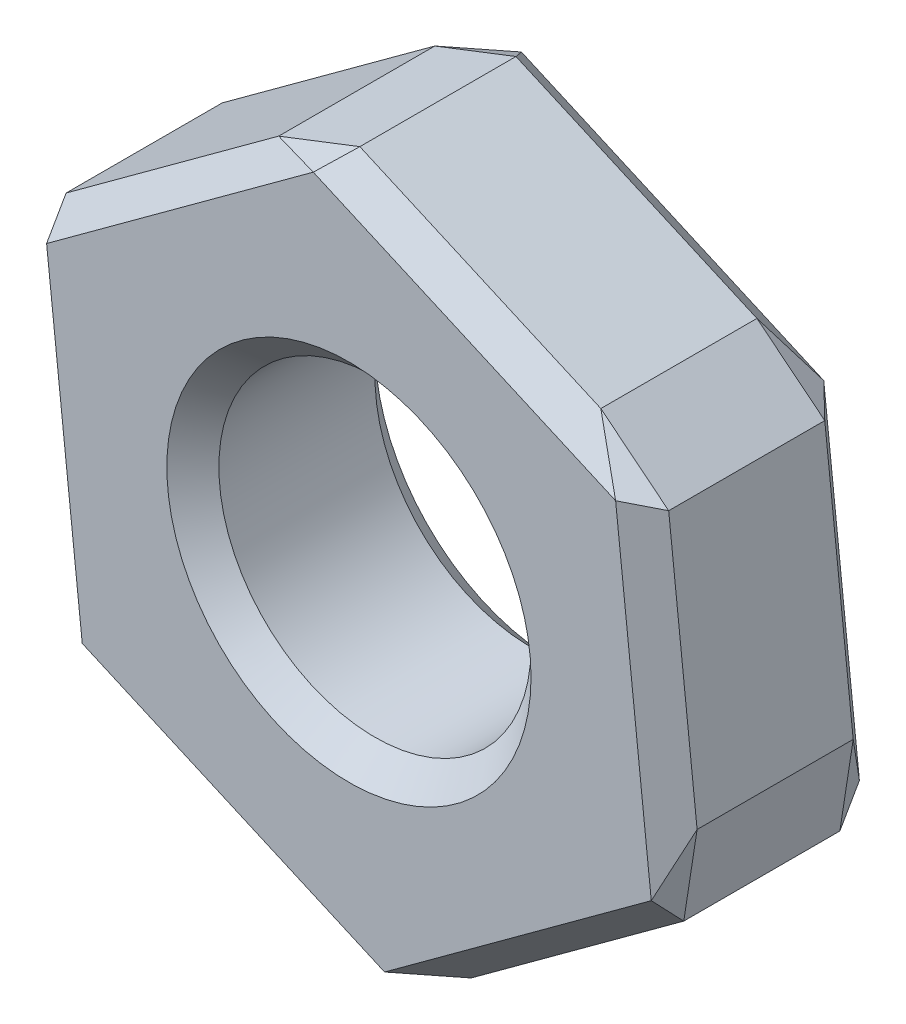
ISO-10303-21;
HEADER;
FILE_DESCRIPTION(('STEP AP214'),'2;1');
FILE_NAME('part.step','',(''),(''),'','','');
FILE_SCHEMA(('AUTOMOTIVE_DESIGN { 1 0 10303 214 1 1 1 1 }'));
ENDSEC;
DATA;
#1=APPLICATION_CONTEXT('core data for automotive mechanical design processes');
#2=APPLICATION_PROTOCOL_DEFINITION('international standard','automotive_design',2000,#1);
#3=PRODUCT_CONTEXT('',#1,'mechanical');
#4=PRODUCT('Part','Part','',(#3));
#5=PRODUCT_RELATED_PRODUCT_CATEGORY('part','',(#4));
#6=PRODUCT_DEFINITION_FORMATION('','',#4);
#7=PRODUCT_DEFINITION_CONTEXT('part definition',#1,'design');
#8=PRODUCT_DEFINITION('design','',#6,#7);
#9=PRODUCT_DEFINITION_SHAPE('','',#8);
#10=(LENGTH_UNIT() NAMED_UNIT(*) SI_UNIT(.MILLI.,.METRE.));
#11=(NAMED_UNIT(*) PLANE_ANGLE_UNIT() SI_UNIT($,.RADIAN.));
#12=(NAMED_UNIT(*) SI_UNIT($,.STERADIAN.) SOLID_ANGLE_UNIT());
#13=UNCERTAINTY_MEASURE_WITH_UNIT(LENGTH_MEASURE(1.E-05),#10,'distance_accuracy_value','');
#14=(GEOMETRIC_REPRESENTATION_CONTEXT(3) GLOBAL_UNCERTAINTY_ASSIGNED_CONTEXT((#13)) GLOBAL_UNIT_ASSIGNED_CONTEXT((#10,
#11,#12)) REPRESENTATION_CONTEXT('',''));
#15=CARTESIAN_POINT('',(0.,0.,0.));
#16=DIRECTION('',(0.,0.,1.));
#17=DIRECTION('',(1.,0.,0.));
#18=AXIS2_PLACEMENT_3D('',#15,#16,#17);
#19=CARTESIAN_POINT('',(0.,0.,2.));
#20=DIRECTION('',(0.,0.,1.));
#21=DIRECTION('',(1.,0.,0.));
#22=AXIS2_PLACEMENT_3D('',#19,#20,#21);
#23=PLANE('',#22);
#24=DIRECTION('',(0.107896227902618,-0.994162161824914,0.));
#25=VECTOR('',#24,1.);
#26=CARTESIAN_POINT('',(-111.632965353091,203.991077085588,2.));
#27=LINE('',#26,#25);
#28=CARTESIAN_POINT('',(-111.991155371379,207.291460888137,2.));
#29=VERTEX_POINT('',#28);
#30=CARTESIAN_POINT('',(-111.648538832147,204.134572033525,2.));
#31=VERTEX_POINT('',#30);
#32=EDGE_CURVE('E257',#29,#31,#27,.T.);
#33=ORIENTED_EDGE('',*,*,#32,.T.);
#34=DIRECTION('',(0.914917801572941,-0.403640206576274,0.));
#35=VECTOR('',#34,1.);
#36=CARTESIAN_POINT('',(-108.611227607756,202.79458178747,2.));
#37=LINE('',#36,#35);
#38=CARTESIAN_POINT('',(-108.743284617512,202.852842232951,2.));
#39=VERTEX_POINT('',#38);
#40=EDGE_CURVE('E259',#31,#39,#37,.T.);
#41=ORIENTED_EDGE('',*,*,#40,.T.);
#42=DIRECTION('',(0.807021573670326,0.590521955248635,0.));
#43=VECTOR('',#42,1.);
#44=CARTESIAN_POINT('',(-106.06416341141,204.813235789445,2.));
#45=LINE('',#44,#43);
#46=CARTESIAN_POINT('',(-106.18064694211,204.728001286989,2.));
#47=VERTEX_POINT('',#46);
#48=EDGE_CURVE('E249',#39,#47,#45,.T.);
#49=ORIENTED_EDGE('',*,*,#48,.T.);
#50=DIRECTION('',(-0.107896227902617,0.994162161824914,0.));
#51=VECTOR('',#50,1.);
#52=CARTESIAN_POINT('',(-106.538836960398,208.028385089539,2.));
#53=LINE('',#52,#51);
#54=CARTESIAN_POINT('',(-106.523263481342,207.884890141602,2.));
#55=VERTEX_POINT('',#54);
#56=EDGE_CURVE('E251',#47,#55,#53,.T.);
#57=ORIENTED_EDGE('',*,*,#56,.T.);
#58=DIRECTION('',(-0.914917801572941,0.403640206576274,0.));
#59=VECTOR('',#58,1.);
#60=CARTESIAN_POINT('',(-109.560574705733,209.224880387657,2.));
#61=LINE('',#60,#59);
#62=CARTESIAN_POINT('',(-109.428517695977,209.166619942176,2.));
#63=VERTEX_POINT('',#62);
#64=EDGE_CURVE('E253',#55,#63,#61,.T.);
#65=ORIENTED_EDGE('',*,*,#64,.T.);
#66=DIRECTION('',(-0.807021573670322,-0.590521955248641,0.));
#67=VECTOR('',#66,1.);
#68=CARTESIAN_POINT('',(-112.10763890208,207.206226385681,2.));
#69=LINE('',#68,#67);
#70=EDGE_CURVE('E255',#63,#29,#69,.T.);
#71=ORIENTED_EDGE('',*,*,#70,.T.);
#72=EDGE_LOOP('',(#33,#41,#49,#57,#65,#71));
#73=FACE_BOUND('',#72,.T.);
#74=CARTESIAN_POINT('',(-109.085901156745,206.009731087563,2.));
#75=DIRECTION('',(0.,0.,1.));
#76=DIRECTION('',(1.,0.,0.));
#77=AXIS2_PLACEMENT_3D('',#74,#75,#76);
#78=CIRCLE('',#77,1.74999999999996);
#79=CARTESIAN_POINT('',(-107.335901156745,206.009731087563,2.));
#80=VERTEX_POINT('',#79);
#81=EDGE_CURVE('E246',#80,#80,#78,.F.);
#82=ORIENTED_EDGE('',*,*,#81,.T.);
#83=EDGE_LOOP('',(#82));
#84=FACE_BOUND('',#83,.T.);
#85=ADVANCED_FACE('F34',(#73,#84),#23,.T.);
#86=CARTESIAN_POINT('',(0.,0.,0.));
#87=DIRECTION('',(0.,0.,1.));
#88=DIRECTION('',(1.,0.,0.));
#89=AXIS2_PLACEMENT_3D('',#86,#87,#88);
#90=PLANE('',#89);
#91=DIRECTION('',(-0.807021573670326,-0.590521955248635,0.));
#92=VECTOR('',#91,1.);
#93=CARTESIAN_POINT('',(-134.592896079612,183.937904143262,0.));
#94=LINE('',#93,#92);
#95=CARTESIAN_POINT('',(-106.18064694211,204.728001286989,0.));
#96=VERTEX_POINT('',#95);
#97=CARTESIAN_POINT('',(-108.743284617512,202.852842232951,0.));
#98=VERTEX_POINT('',#97);
#99=EDGE_CURVE('E265',#96,#98,#94,.T.);
#100=ORIENTED_EDGE('',*,*,#99,.T.);
#101=DIRECTION('',(-0.914917801572941,0.403640206576274,0.));
#102=VECTOR('',#101,1.);
#103=CARTESIAN_POINT('',(57.1960249817979,129.644323292083,0.));
#104=LINE('',#103,#102);
#105=CARTESIAN_POINT('',(-111.648538832147,204.134572033525,0.));
#106=VERTEX_POINT('',#105);
#107=EDGE_CURVE('E274',#98,#106,#104,.T.);
#108=ORIENTED_EDGE('',*,*,#107,.T.);
#109=DIRECTION('',(-0.107896227902618,0.994162161824914,0.));
#110=VECTOR('',#109,1.);
#111=CARTESIAN_POINT('',(-88.4520017734713,-9.59967871265047,0.));
#112=LINE('',#111,#110);
#113=CARTESIAN_POINT('',(-111.991155371379,207.291460888137,0.));
#114=VERTEX_POINT('',#113);
#115=EDGE_CURVE('E60',#106,#114,#112,.T.);
#116=ORIENTED_EDGE('',*,*,#115,.T.);
#117=DIRECTION('',(0.807021573670322,0.590521955248641,0.));
#118=VECTOR('',#117,1.);
#119=CARTESIAN_POINT('',(-137.840766833481,188.376522798448,0.));
#120=LINE('',#119,#118);
#121=CARTESIAN_POINT('',(-109.428517695977,209.166619942176,0.));
#122=VERTEX_POINT('',#121);
#123=EDGE_CURVE('E271',#114,#122,#120,.T.);
#124=ORIENTED_EDGE('',*,*,#123,.T.);
#125=DIRECTION('',(0.914917801572941,-0.403640206576274,0.));
#126=VECTOR('',#125,1.);
#127=CARTESIAN_POINT('',(59.4160461179675,134.676371200734,0.));
#128=LINE('',#127,#126);
#129=CARTESIAN_POINT('',(-106.523263481342,207.884890141602,0.));
#130=VERTEX_POINT('',#129);
#131=EDGE_CURVE('E269',#122,#130,#128,.T.);
#132=ORIENTED_EDGE('',*,*,#131,.T.);
#133=DIRECTION('',(0.107896227902617,-0.994162161824914,0.));
#134=VECTOR('',#133,1.);
#135=CARTESIAN_POINT('',(-82.9841098834344,-9.00624945918601,0.));
#136=LINE('',#135,#134);
#137=EDGE_CURVE('E267',#130,#96,#136,.T.);
#138=ORIENTED_EDGE('',*,*,#137,.T.);
#139=EDGE_LOOP('',(#100,#108,#116,#124,#132,#138));
#140=FACE_BOUND('',#139,.T.);
#141=CARTESIAN_POINT('',(-109.085901156745,206.009731087563,0.));
#142=DIRECTION('',(0.,0.,1.));
#143=DIRECTION('',(1.,0.,0.));
#144=AXIS2_PLACEMENT_3D('',#141,#142,#143);
#145=CIRCLE('',#144,1.74999999999996);
#146=CARTESIAN_POINT('',(-107.335901156745,206.009731087563,0.));
#147=VERTEX_POINT('',#146);
#148=EDGE_CURVE('E262',#147,#147,#145,.T.);
#149=ORIENTED_EDGE('',*,*,#148,.T.);
#150=EDGE_LOOP('',(#149));
#151=FACE_BOUND('',#150,.T.);
#152=ADVANCED_FACE('F435',(#140,#151),#90,.F.);
#153=CARTESIAN_POINT('',(-108.7121376594,202.565852337077,2.));
#154=DIRECTION('',(-0.590521955248635,0.807021573670326,0.));
#155=DIRECTION('',(-0.807021573670326,-0.590521955248635,0.));
#156=AXIS2_PLACEMENT_3D('',#153,#154,#155);
#157=PLANE('',#156);
#158=DIRECTION('',(0.,0.,1.));
#159=VECTOR('',#158,1.);
#160=CARTESIAN_POINT('',(-106.118288316015,204.463849907216,2.));
#161=LINE('',#160,#159);
#162=CARTESIAN_POINT('',(-106.118288316015,204.463849907216,0.250000000000003));
#163=VERTEX_POINT('',#162);
#164=CARTESIAN_POINT('',(-106.118288316015,204.463849907216,1.75));
#165=VERTEX_POINT('',#164);
#166=EDGE_CURVE('E171',#163,#165,#161,.T.);
#167=ORIENTED_EDGE('',*,*,#166,.T.);
#168=DIRECTION('',(-0.807021573670326,-0.590521955248635,0.));
#169=VECTOR('',#168,1.);
#170=CARTESIAN_POINT('',(-108.7121376594,202.565852337077,1.75));
#171=LINE('',#170,#169);
#172=CARTESIAN_POINT('',(-108.160931673882,202.969186333258,1.75));
#173=VERTEX_POINT('',#172);
#174=EDGE_CURVE('E208',#165,#173,#171,.T.);
#175=ORIENTED_EDGE('',*,*,#174,.T.);
#176=DIRECTION('',(0.,0.,-1.));
#177=VECTOR('',#176,1.);
#178=CARTESIAN_POINT('',(-108.160931673882,202.969186333258,2.));
#179=LINE('',#178,#177);
#180=CARTESIAN_POINT('',(-108.160931673882,202.969186333258,0.250000000000003));
#181=VERTEX_POINT('',#180);
#182=EDGE_CURVE('E205',#173,#181,#179,.T.);
#183=ORIENTED_EDGE('',*,*,#182,.T.);
#184=DIRECTION('',(0.807021573670326,0.590521955248635,0.));
#185=VECTOR('',#184,1.);
#186=CARTESIAN_POINT('',(-108.7121376594,202.565852337077,0.250000000000003));
#187=LINE('',#186,#185);
#188=EDGE_CURVE('E200',#181,#163,#187,.T.);
#189=ORIENTED_EDGE('',*,*,#188,.T.);
#190=EDGE_LOOP('',(#167,#175,#183,#189));
#191=FACE_BOUND('',#190,.T.);
#192=ADVANCED_FACE('F440',(#191),#157,.F.);
#193=CARTESIAN_POINT('',(-105.916532922597,204.611480396028,2.));
#194=DIRECTION('',(-0.994162161824914,-0.107896227902617,0.));
#195=DIRECTION('',(0.107896227902617,-0.994162161824914,0.));
#196=AXIS2_PLACEMENT_3D('',#193,#194,#195);
#197=PLANE('',#196);
#198=DIRECTION('',(0.,0.,1.));
#199=VECTOR('',#198,1.);
#200=CARTESIAN_POINT('',(-106.263322362967,207.806818606058,2.));
#201=LINE('',#200,#199);
#202=CARTESIAN_POINT('',(-106.263322362967,207.806818606058,0.250000000000003));
#203=VERTEX_POINT('',#202);
#204=CARTESIAN_POINT('',(-106.263322362967,207.806818606058,1.75));
#205=VERTEX_POINT('',#204);
#206=EDGE_CURVE('E193',#203,#205,#201,.T.);
#207=ORIENTED_EDGE('',*,*,#206,.T.);
#208=DIRECTION('',(0.107896227902617,-0.994162161824914,0.));
#209=VECTOR('',#208,1.);
#210=CARTESIAN_POINT('',(-105.916532922597,204.611480396028,1.75));
#211=LINE('',#210,#209);
#212=CARTESIAN_POINT('',(-105.990227416741,205.290505780295,1.75));
#213=VERTEX_POINT('',#212);
#214=EDGE_CURVE('E197',#205,#213,#211,.T.);
#215=ORIENTED_EDGE('',*,*,#214,.T.);
#216=DIRECTION('',(0.,0.,-1.));
#217=VECTOR('',#216,1.);
#218=CARTESIAN_POINT('',(-105.990227416741,205.290505780295,2.));
#219=LINE('',#218,#217);
#220=CARTESIAN_POINT('',(-105.990227416741,205.290505780295,0.250000000000003));
#221=VERTEX_POINT('',#220);
#222=EDGE_CURVE('E169',#213,#221,#219,.T.);
#223=ORIENTED_EDGE('',*,*,#222,.T.);
#224=DIRECTION('',(-0.107896227902617,0.994162161824914,0.));
#225=VECTOR('',#224,1.);
#226=CARTESIAN_POINT('',(-105.916532922597,204.611480396028,0.250000000000003));
#227=LINE('',#226,#225);
#228=EDGE_CURVE('E187',#221,#203,#227,.T.);
#229=ORIENTED_EDGE('',*,*,#228,.T.);
#230=EDGE_LOOP('',(#207,#215,#223,#229));
#231=FACE_BOUND('',#230,.T.);
#232=ADVANCED_FACE('F195',(#231),#197,.F.);
#233=CARTESIAN_POINT('',(-106.290296419942,208.055359146514,2.));
#234=DIRECTION('',(-0.403640206576274,-0.914917801572941,0.));
#235=DIRECTION('',(0.914917801572941,-0.403640206576274,0.));
#236=AXIS2_PLACEMENT_3D('',#233,#234,#235);
#237=PLANE('',#236);
#238=DIRECTION('',(0.,0.,1.));
#239=VECTOR('',#238,1.);
#240=CARTESIAN_POINT('',(-109.230935203696,209.352699786406,2.));
#241=LINE('',#240,#239);
#242=CARTESIAN_POINT('',(-109.230935203696,209.352699786406,0.250000000000003));
#243=VERTEX_POINT('',#242);
#244=CARTESIAN_POINT('',(-109.230935203696,209.352699786406,1.75));
#245=VERTEX_POINT('',#244);
#246=EDGE_CURVE('E212',#243,#245,#241,.T.);
#247=ORIENTED_EDGE('',*,*,#246,.T.);
#248=DIRECTION('',(0.914917801572941,-0.403640206576274,0.));
#249=VECTOR('',#248,1.);
#250=CARTESIAN_POINT('',(-106.290296419942,208.055359146514,1.75));
#251=LINE('',#250,#249);
#252=CARTESIAN_POINT('',(-106.915196899604,208.3310505346,1.75));
#253=VERTEX_POINT('',#252);
#254=EDGE_CURVE('E217',#245,#253,#251,.T.);
#255=ORIENTED_EDGE('',*,*,#254,.T.);
#256=DIRECTION('',(0.,0.,-1.));
#257=VECTOR('',#256,1.);
#258=CARTESIAN_POINT('',(-106.915196899604,208.3310505346,2.));
#259=LINE('',#258,#257);
#260=CARTESIAN_POINT('',(-106.915196899604,208.3310505346,0.250000000000003));
#261=VERTEX_POINT('',#260);
#262=EDGE_CURVE('E214',#253,#261,#259,.T.);
#263=ORIENTED_EDGE('',*,*,#262,.T.);
#264=DIRECTION('',(-0.914917801572941,0.403640206576274,0.));
#265=VECTOR('',#264,1.);
#266=CARTESIAN_POINT('',(-106.290296419942,208.055359146514,0.250000000000003));
#267=LINE('',#266,#265);
#268=EDGE_CURVE('E210',#261,#243,#267,.T.);
#269=ORIENTED_EDGE('',*,*,#268,.T.);
#270=EDGE_LOOP('',(#247,#255,#263,#269));
#271=FACE_BOUND('',#270,.T.);
#272=ADVANCED_FACE('F453',(#271),#237,.F.);
#273=CARTESIAN_POINT('',(-109.459664654089,209.45360983805,2.));
#274=DIRECTION('',(0.590521955248641,-0.807021573670322,0.));
#275=DIRECTION('',(0.807021573670322,0.590521955248641,0.));
#276=AXIS2_PLACEMENT_3D('',#273,#274,#275);
#277=PLANE('',#276);
#278=DIRECTION('',(0.,0.,1.));
#279=VECTOR('',#278,1.);
#280=CARTESIAN_POINT('',(-112.053513997474,207.555612267911,2.));
#281=LINE('',#280,#279);
#282=CARTESIAN_POINT('',(-112.053513997474,207.555612267911,0.250000000000003));
#283=VERTEX_POINT('',#282);
#284=CARTESIAN_POINT('',(-112.053513997474,207.555612267911,1.75));
#285=VERTEX_POINT('',#284);
#286=EDGE_CURVE('E221',#283,#285,#281,.T.);
#287=ORIENTED_EDGE('',*,*,#286,.T.);
#288=DIRECTION('',(0.807021573670322,0.590521955248641,0.));
#289=VECTOR('',#288,1.);
#290=CARTESIAN_POINT('',(-109.459664654089,209.45360983805,1.75));
#291=LINE('',#290,#289);
#292=CARTESIAN_POINT('',(-110.010870639607,209.050275841869,1.75));
#293=VERTEX_POINT('',#292);
#294=EDGE_CURVE('E226',#285,#293,#291,.T.);
#295=ORIENTED_EDGE('',*,*,#294,.T.);
#296=DIRECTION('',(0.,0.,-1.));
#297=VECTOR('',#296,1.);
#298=CARTESIAN_POINT('',(-110.010870639607,209.050275841869,2.));
#299=LINE('',#298,#297);
#300=CARTESIAN_POINT('',(-110.010870639607,209.050275841869,0.250000000000003));
#301=VERTEX_POINT('',#300);
#302=EDGE_CURVE('E223',#293,#301,#299,.T.);
#303=ORIENTED_EDGE('',*,*,#302,.T.);
#304=DIRECTION('',(-0.807021573670322,-0.590521955248641,0.));
#305=VECTOR('',#304,1.);
#306=CARTESIAN_POINT('',(-109.459664654089,209.45360983805,0.250000000000003));
#307=LINE('',#306,#305);
#308=EDGE_CURVE('E219',#301,#283,#307,.T.);
#309=ORIENTED_EDGE('',*,*,#308,.T.);
#310=EDGE_LOOP('',(#287,#295,#303,#309));
#311=FACE_BOUND('',#310,.T.);
#312=ADVANCED_FACE('F393',(#311),#277,.F.);
#313=CARTESIAN_POINT('',(-112.255269390892,207.407981779099,2.));
#314=DIRECTION('',(0.994162161824914,0.107896227902618,0.));
#315=DIRECTION('',(-0.107896227902618,0.994162161824914,0.));
#316=AXIS2_PLACEMENT_3D('',#313,#314,#315);
#317=PLANE('',#316);
#318=DIRECTION('',(0.,0.,1.));
#319=VECTOR('',#318,1.);
#320=CARTESIAN_POINT('',(-111.908479950523,204.212643569068,2.));
#321=LINE('',#320,#319);
#322=CARTESIAN_POINT('',(-111.908479950523,204.212643569068,0.250000000000003));
#323=VERTEX_POINT('',#322);
#324=CARTESIAN_POINT('',(-111.908479950523,204.212643569068,1.75));
#325=VERTEX_POINT('',#324);
#326=EDGE_CURVE('E230',#323,#325,#321,.T.);
#327=ORIENTED_EDGE('',*,*,#326,.T.);
#328=DIRECTION('',(-0.107896227902618,0.994162161824914,0.));
#329=VECTOR('',#328,1.);
#330=CARTESIAN_POINT('',(-112.255269390892,207.407981779099,1.75));
#331=LINE('',#330,#329);
#332=CARTESIAN_POINT('',(-112.181574896748,206.728956394832,1.75));
#333=VERTEX_POINT('',#332);
#334=EDGE_CURVE('E235',#325,#333,#331,.T.);
#335=ORIENTED_EDGE('',*,*,#334,.T.);
#336=DIRECTION('',(0.,0.,-1.));
#337=VECTOR('',#336,1.);
#338=CARTESIAN_POINT('',(-112.181574896748,206.728956394832,2.));
#339=LINE('',#338,#337);
#340=CARTESIAN_POINT('',(-112.181574896748,206.728956394832,0.250000000000003));
#341=VERTEX_POINT('',#340);
#342=EDGE_CURVE('E232',#333,#341,#339,.T.);
#343=ORIENTED_EDGE('',*,*,#342,.T.);
#344=DIRECTION('',(0.107896227902618,-0.994162161824914,0.));
#345=VECTOR('',#344,1.);
#346=CARTESIAN_POINT('',(-112.255269390892,207.407981779099,0.250000000000003));
#347=LINE('',#346,#345);
#348=EDGE_CURVE('E228',#341,#323,#347,.T.);
#349=ORIENTED_EDGE('',*,*,#348,.T.);
#350=EDGE_LOOP('',(#327,#335,#343,#349));
#351=FACE_BOUND('',#350,.T.);
#352=ADVANCED_FACE('F409',(#351),#317,.F.);
#353=CARTESIAN_POINT('',(-111.881505893547,203.964103028612,2.));
#354=DIRECTION('',(0.403640206576274,0.914917801572941,0.));
#355=DIRECTION('',(-0.914917801572941,0.403640206576274,0.));
#356=AXIS2_PLACEMENT_3D('',#353,#354,#355);
#357=PLANE('',#356);
#358=DIRECTION('',(0.,0.,1.));
#359=VECTOR('',#358,1.);
#360=CARTESIAN_POINT('',(-108.940867109793,202.666762388721,2.));
#361=LINE('',#360,#359);
#362=CARTESIAN_POINT('',(-108.940867109793,202.666762388721,0.250000000000003));
#363=VERTEX_POINT('',#362);
#364=CARTESIAN_POINT('',(-108.940867109793,202.666762388721,1.75));
#365=VERTEX_POINT('',#364);
#366=EDGE_CURVE('E239',#363,#365,#361,.T.);
#367=ORIENTED_EDGE('',*,*,#366,.T.);
#368=DIRECTION('',(-0.914917801572941,0.403640206576274,0.));
#369=VECTOR('',#368,1.);
#370=CARTESIAN_POINT('',(-111.881505893547,203.964103028612,1.75));
#371=LINE('',#370,#369);
#372=CARTESIAN_POINT('',(-111.256605413885,203.688411640526,1.75));
#373=VERTEX_POINT('',#372);
#374=EDGE_CURVE('E244',#365,#373,#371,.T.);
#375=ORIENTED_EDGE('',*,*,#374,.T.);
#376=DIRECTION('',(0.,0.,-1.));
#377=VECTOR('',#376,1.);
#378=CARTESIAN_POINT('',(-111.256605413885,203.688411640526,2.));
#379=LINE('',#378,#377);
#380=CARTESIAN_POINT('',(-111.256605413885,203.688411640526,0.250000000000003));
#381=VERTEX_POINT('',#380);
#382=EDGE_CURVE('E241',#373,#381,#379,.T.);
#383=ORIENTED_EDGE('',*,*,#382,.T.);
#384=DIRECTION('',(0.914917801572941,-0.403640206576274,0.));
#385=VECTOR('',#384,1.);
#386=CARTESIAN_POINT('',(-111.881505893547,203.964103028612,0.250000000000003));
#387=LINE('',#386,#385);
#388=EDGE_CURVE('E237',#381,#363,#387,.T.);
#389=ORIENTED_EDGE('',*,*,#388,.T.);
#390=EDGE_LOOP('',(#367,#375,#383,#389));
#391=FACE_BOUND('',#390,.T.);
#392=ADVANCED_FACE('F445',(#391),#357,.F.);
#393=CARTESIAN_POINT('',(-109.085901156745,206.009731087563,2.));
#394=DIRECTION('',(0.,0.,-1.));
#395=DIRECTION('',(-1.,0.,0.));
#396=AXIS2_PLACEMENT_3D('',#393,#394,#395);
#397=CYLINDRICAL_SURFACE('',#396,1.49999999999996);
#398=CARTESIAN_POINT('',(-109.085901156745,206.009731087563,1.75));
#399=DIRECTION('',(0.,0.,1.));
#400=DIRECTION('',(1.,0.,0.));
#401=AXIS2_PLACEMENT_3D('',#398,#399,#400);
#402=CIRCLE('',#401,1.49999999999996);
#403=CARTESIAN_POINT('',(-107.585901156745,206.009731087563,1.75));
#404=VERTEX_POINT('',#403);
#405=EDGE_CURVE('E11',#404,#404,#402,.T.);
#406=ORIENTED_EDGE('',*,*,#405,.T.);
#407=EDGE_LOOP('',(#406));
#408=FACE_BOUND('',#407,.T.);
#409=CARTESIAN_POINT('',(-109.085901156745,206.009731087563,0.249999999999997));
#410=DIRECTION('',(0.,0.,1.));
#411=DIRECTION('',(1.,0.,0.));
#412=AXIS2_PLACEMENT_3D('',#409,#410,#411);
#413=CIRCLE('',#412,1.49999999999996);
#414=CARTESIAN_POINT('',(-107.585901156745,206.009731087563,0.249999999999997));
#415=VERTEX_POINT('',#414);
#416=EDGE_CURVE('E44',#415,#415,#413,.F.);
#417=ORIENTED_EDGE('',*,*,#416,.T.);
#418=EDGE_LOOP('',(#417));
#419=FACE_BOUND('',#418,.T.);
#420=ADVANCED_FACE('F443',(#408,#419),#397,.F.);
#421=CARTESIAN_POINT('',(-112.181574896748,206.728956394832,2.));
#422=DIRECTION('',(0.988212506301984,-0.15308834831022,0.));
#423=DIRECTION('',(0.,0.,-1.));
#424=AXIS2_PLACEMENT_3D('',#421,#422,#423);
#425=PLANE('',#424);
#426=DIRECTION('',(0.15308834831022,0.988212506301984,0.));
#427=VECTOR('',#426,1.);
#428=CARTESIAN_POINT('',(-112.053513997474,207.555612267911,1.75));
#429=LINE('',#428,#427);
#430=EDGE_CURVE('E39',#285,#333,#429,.F.);
#431=ORIENTED_EDGE('',*,*,#430,.F.);
#432=ORIENTED_EDGE('',*,*,#286,.F.);
#433=DIRECTION('',(-0.15308834831022,-0.988212506301984,0.));
#434=VECTOR('',#433,1.);
#435=CARTESIAN_POINT('',(-112.181574896748,206.728956394832,0.250000000000003));
#436=LINE('',#435,#434);
#437=EDGE_CURVE('E360',#341,#283,#436,.F.);
#438=ORIENTED_EDGE('',*,*,#437,.F.);
#439=ORIENTED_EDGE('',*,*,#342,.F.);
#440=EDGE_LOOP('',(#431,#432,#438,#439));
#441=FACE_BOUND('',#440,.T.);
#442=ADVANCED_FACE('F407',(#441),#425,.F.);
#443=CARTESIAN_POINT('',(-112.053513997474,207.555612267911,1.75));
#444=DIRECTION('',(-0.914907001180993,0.141732269906589,0.377964473009208));
#445=DIRECTION('',(0.381818924514097,0.,0.924237149698549));
#446=AXIS2_PLACEMENT_3D('',#443,#444,#445);
#447=PLANE('',#446);
#448=DIRECTION('',(-0.168991363884456,0.715848066827047,-0.67749794402083));
#449=VECTOR('',#448,1.);
#450=CARTESIAN_POINT('',(-112.053513997474,207.555612267911,1.75));
#451=LINE('',#450,#449);
#452=EDGE_CURVE('E355',#285,#29,#451,.F.);
#453=ORIENTED_EDGE('',*,*,#452,.F.);
#454=ORIENTED_EDGE('',*,*,#430,.T.);
#455=DIRECTION('',(0.295527585279805,0.872996581070308,0.387995381130034));
#456=VECTOR('',#455,1.);
#457=CARTESIAN_POINT('',(-111.957117771343,207.392008890895,2.04468764425633));
#458=LINE('',#457,#456);
#459=EDGE_CURVE('E358',#29,#333,#458,.F.);
#460=ORIENTED_EDGE('',*,*,#459,.F.);
#461=EDGE_LOOP('',(#453,#454,#460));
#462=FACE_BOUND('',#461,.T.);
#463=ADVANCED_FACE('F371',(#462),#447,.T.);
#464=CARTESIAN_POINT('',(-112.181574896748,206.728956394832,0.250000000000003));
#465=DIRECTION('',(-0.914907001180975,0.141732269906586,-0.377964473009252));
#466=DIRECTION('',(-0.381818924514142,0.,0.924237149698531));
#467=AXIS2_PLACEMENT_3D('',#464,#465,#466);
#468=PLANE('',#467);
#469=DIRECTION('',(0.295527585279835,0.872996581070286,-0.387995381130062));
#470=VECTOR('',#469,1.);
#471=CARTESIAN_POINT('',(-112.181574896748,206.728956394832,0.250000000000003));
#472=LINE('',#471,#470);
#473=EDGE_CURVE('E350',#341,#114,#472,.T.);
#474=ORIENTED_EDGE('',*,*,#473,.F.);
#475=ORIENTED_EDGE('',*,*,#437,.T.);
#476=DIRECTION('',(-0.168991363884502,0.715848066827026,0.677497944020841));
#477=VECTOR('',#476,1.);
#478=CARTESIAN_POINT('',(-111.957168840059,207.147493810858,-0.136254330190557));
#479=LINE('',#478,#477);
#480=EDGE_CURVE('E352',#114,#283,#479,.T.);
#481=ORIENTED_EDGE('',*,*,#480,.F.);
#482=EDGE_LOOP('',(#474,#475,#481));
#483=FACE_BOUND('',#482,.T.);
#484=ADVANCED_FACE('F602',(#483),#468,.T.);
#485=CARTESIAN_POINT('',(-88.4520017734713,-9.59967871265047,2.));
#486=DIRECTION('',(-0.702978806225473,-0.07629415441439,0.707106781186549));
#487=DIRECTION('',(-0.107896227902618,0.994162161824914,0.));
#488=AXIS2_PLACEMENT_3D('',#485,#486,#487);
#489=PLANE('',#488);
#490=ORIENTED_EDGE('',*,*,#459,.T.);
#491=ORIENTED_EDGE('',*,*,#334,.F.);
#492=DIRECTION('',(-0.704438293064443,0.211573219269417,-0.677497944020813));
#493=VECTOR('',#492,1.);
#494=CARTESIAN_POINT('',(-111.908479950523,204.212643569068,1.75));
#495=LINE('',#494,#493);
#496=EDGE_CURVE('E344',#31,#325,#495,.T.);
#497=ORIENTED_EDGE('',*,*,#496,.F.);
#498=ORIENTED_EDGE('',*,*,#32,.F.);
#499=EDGE_LOOP('',(#490,#491,#497,#498));
#500=FACE_BOUND('',#499,.T.);
#501=ADVANCED_FACE('F379',(#500),#489,.T.);
#502=CARTESIAN_POINT('',(-137.840766833481,188.376522798448,2.));
#503=DIRECTION('',(-0.417562078995861,0.570650427306134,0.707106781186534));
#504=DIRECTION('',(0.807021573670322,0.590521955248641,0.));
#505=AXIS2_PLACEMENT_3D('',#502,#503,#504);
#506=PLANE('',#505);
#507=ORIENTED_EDGE('',*,*,#452,.T.);
#508=ORIENTED_EDGE('',*,*,#70,.F.);
#509=DIRECTION('',(0.903801009263743,0.180563894163755,0.38799538113006));
#510=VECTOR('',#509,1.);
#511=CARTESIAN_POINT('',(-109.324421771271,209.187416517239,2.04468764425631));
#512=LINE('',#511,#510);
#513=EDGE_CURVE('E341',#293,#63,#512,.T.);
#514=ORIENTED_EDGE('',*,*,#513,.F.);
#515=ORIENTED_EDGE('',*,*,#294,.F.);
#516=EDGE_LOOP('',(#507,#508,#514,#515));
#517=FACE_BOUND('',#516,.T.);
#518=ADVANCED_FACE('F390',(#517),#506,.T.);
#519=CARTESIAN_POINT('',(-110.010870639607,209.050275841869,2.));
#520=DIRECTION('',(0.361527854490925,-0.932361308950124,0.));
#521=DIRECTION('',(0.,0.,-1.));
#522=AXIS2_PLACEMENT_3D('',#519,#520,#521);
#523=PLANE('',#522);
#524=DIRECTION('',(-0.932361308950124,-0.361527854490925,0.));
#525=VECTOR('',#524,1.);
#526=CARTESIAN_POINT('',(-110.010870639607,209.050275841869,0.250000000000003));
#527=LINE('',#526,#525);
#528=EDGE_CURVE('E335',#301,#243,#527,.F.);
#529=ORIENTED_EDGE('',*,*,#528,.F.);
#530=ORIENTED_EDGE('',*,*,#302,.F.);
#531=DIRECTION('',(0.932361308950124,0.361527854490925,0.));
#532=VECTOR('',#531,1.);
#533=CARTESIAN_POINT('',(-109.230935203696,209.352699786406,1.75));
#534=LINE('',#533,#532);
#535=EDGE_CURVE('E338',#245,#293,#534,.F.);
#536=ORIENTED_EDGE('',*,*,#535,.F.);
#537=ORIENTED_EDGE('',*,*,#246,.F.);
#538=EDGE_LOOP('',(#529,#530,#536,#537));
#539=FACE_BOUND('',#538,.T.);
#540=ADVANCED_FACE('F397',(#539),#523,.F.);
#541=CARTESIAN_POINT('',(-109.459664654089,209.45360983805,0.250000000000003));
#542=DIRECTION('',(0.417562078995861,-0.570650427306134,0.707106781186534));
#543=DIRECTION('',(-0.807021573670322,-0.590521955248641,0.));
#544=AXIS2_PLACEMENT_3D('',#541,#542,#543);
#545=PLANE('',#544);
#546=ORIENTED_EDGE('',*,*,#480,.T.);
#547=ORIENTED_EDGE('',*,*,#308,.F.);
#548=DIRECTION('',(0.903801009263743,0.180563894163754,-0.387995381130061));
#549=VECTOR('',#548,1.);
#550=CARTESIAN_POINT('',(-110.010870639607,209.050275841869,0.250000000000003));
#551=LINE('',#550,#549);
#552=EDGE_CURVE('E333',#122,#301,#551,.F.);
#553=ORIENTED_EDGE('',*,*,#552,.F.);
#554=ORIENTED_EDGE('',*,*,#123,.F.);
#555=EDGE_LOOP('',(#546,#547,#553,#554));
#556=FACE_BOUND('',#555,.T.);
#557=ADVANCED_FACE('F405',(#556),#545,.F.);
#558=CARTESIAN_POINT('',(-112.255269390892,207.407981779099,0.250000000000003));
#559=DIRECTION('',(0.702978806225473,0.07629415441439,0.707106781186549));
#560=DIRECTION('',(0.107896227902618,-0.994162161824914,0.));
#561=AXIS2_PLACEMENT_3D('',#558,#559,#560);
#562=PLANE('',#561);
#563=ORIENTED_EDGE('',*,*,#473,.T.);
#564=ORIENTED_EDGE('',*,*,#115,.F.);
#565=DIRECTION('',(-0.704438293064435,0.211573219269493,0.677497944020797));
#566=VECTOR('',#565,1.);
#567=CARTESIAN_POINT('',(-111.506866420254,204.092021694395,-0.136254330190558));
#568=LINE('',#567,#566);
#569=EDGE_CURVE('E331',#323,#106,#568,.F.);
#570=ORIENTED_EDGE('',*,*,#569,.F.);
#571=ORIENTED_EDGE('',*,*,#348,.F.);
#572=EDGE_LOOP('',(#563,#564,#570,#571));
#573=FACE_BOUND('',#572,.T.);
#574=ADVANCED_FACE('F417',(#573),#562,.F.);
#575=CARTESIAN_POINT('',(-111.256605413885,203.688411640526,2.));
#576=DIRECTION('',(0.626684651811067,0.779272960639879,0.));
#577=DIRECTION('',(0.,0.,-1.));
#578=AXIS2_PLACEMENT_3D('',#575,#576,#577);
#579=PLANE('',#578);
#580=DIRECTION('',(-0.779272960639879,0.626684651811067,0.));
#581=VECTOR('',#580,1.);
#582=CARTESIAN_POINT('',(-111.908479950523,204.212643569068,1.75));
#583=LINE('',#582,#581);
#584=EDGE_CURVE('E347',#325,#373,#583,.F.);
#585=ORIENTED_EDGE('',*,*,#584,.F.);
#586=ORIENTED_EDGE('',*,*,#326,.F.);
#587=DIRECTION('',(0.779272960639879,-0.626684651811067,0.));
#588=VECTOR('',#587,1.);
#589=CARTESIAN_POINT('',(-111.256605413885,203.688411640526,0.250000000000003));
#590=LINE('',#589,#588);
#591=EDGE_CURVE('E328',#381,#323,#590,.F.);
#592=ORIENTED_EDGE('',*,*,#591,.F.);
#593=ORIENTED_EDGE('',*,*,#382,.F.);
#594=EDGE_LOOP('',(#585,#586,#592,#593));
#595=FACE_BOUND('',#594,.T.);
#596=ADVANCED_FACE('F414',(#595),#579,.F.);
#597=CARTESIAN_POINT('',(-111.908479950523,204.212643569068,1.75));
#598=DIRECTION('',(-0.580197246865643,-0.721466570169669,0.377964473009226));
#599=DIRECTION('',(0.779272960639884,-0.62668465181106,0.));
#600=AXIS2_PLACEMENT_3D('',#597,#598,#599);
#601=PLANE('',#600);
#602=ORIENTED_EDGE('',*,*,#496,.T.);
#603=ORIENTED_EDGE('',*,*,#584,.T.);
#604=DIRECTION('',(-0.608273423983902,0.692432686906554,0.387995381130073));
#605=VECTOR('',#604,1.);
#606=CARTESIAN_POINT('',(-111.718597156817,204.214323461219,2.04468764425637));
#607=LINE('',#606,#605);
#608=EDGE_CURVE('E325',#31,#373,#607,.F.);
#609=ORIENTED_EDGE('',*,*,#608,.F.);
#610=EDGE_LOOP('',(#602,#603,#609));
#611=FACE_BOUND('',#610,.T.);
#612=ADVANCED_FACE('F574',(#611),#601,.T.);
#613=CARTESIAN_POINT('',(-109.230935203696,209.352699786406,1.75));
#614=DIRECTION('',(-0.334709754315344,0.863198840076297,0.377964473009168));
#615=DIRECTION('',(0.,-0.401099374587467,0.916034547222725));
#616=AXIS2_PLACEMENT_3D('',#613,#614,#615);
#617=PLANE('',#616);
#618=ORIENTED_EDGE('',*,*,#535,.T.);
#619=ORIENTED_EDGE('',*,*,#513,.T.);
#620=DIRECTION('',(0.535446929179952,0.504274847557602,-0.677497944020878));
#621=VECTOR('',#620,1.);
#622=CARTESIAN_POINT('',(-109.230935203696,209.352699786406,1.75));
#623=LINE('',#622,#621);
#624=EDGE_CURVE('E322',#245,#63,#623,.F.);
#625=ORIENTED_EDGE('',*,*,#624,.F.);
#626=EDGE_LOOP('',(#618,#619,#625));
#627=FACE_BOUND('',#626,.T.);
#628=ADVANCED_FACE('F431',(#627),#617,.T.);
#629=CARTESIAN_POINT('',(-110.010870639607,209.050275841869,0.250000000000003));
#630=DIRECTION('',(-0.334709754315343,0.863198840076297,-0.377964473009167));
#631=DIRECTION('',(0.,0.401099374587466,0.916034547222725));
#632=AXIS2_PLACEMENT_3D('',#629,#630,#631);
#633=PLANE('',#632);
#634=ORIENTED_EDGE('',*,*,#552,.T.);
#635=ORIENTED_EDGE('',*,*,#528,.T.);
#636=DIRECTION('',(0.535446929179954,0.504274847557601,0.677497944020878));
#637=VECTOR('',#636,1.);
#638=CARTESIAN_POINT('',(-109.53620357655,209.065203204026,-0.136254330190536));
#639=LINE('',#638,#637);
#640=EDGE_CURVE('E319',#122,#243,#639,.T.);
#641=ORIENTED_EDGE('',*,*,#640,.F.);
#642=EDGE_LOOP('',(#634,#635,#641));
#643=FACE_BOUND('',#642,.T.);
#644=ADVANCED_FACE('F422',(#643),#633,.T.);
#645=CARTESIAN_POINT('',(-111.256605413885,203.688411640526,0.250000000000003));
#646=DIRECTION('',(-0.580197246865659,-0.721466570169692,-0.377964473009157));
#647=DIRECTION('',(0.779272960639885,-0.626684651811059,0.));
#648=AXIS2_PLACEMENT_3D('',#645,#646,#647);
#649=PLANE('',#648);
#650=ORIENTED_EDGE('',*,*,#591,.T.);
#651=ORIENTED_EDGE('',*,*,#569,.T.);
#652=DIRECTION('',(-0.608273423983958,0.69243268690653,-0.387995381130029));
#653=VECTOR('',#652,1.);
#654=CARTESIAN_POINT('',(-111.256605413885,203.688411640526,0.250000000000003));
#655=LINE('',#654,#653);
#656=EDGE_CURVE('E52',#381,#106,#655,.T.);
#657=ORIENTED_EDGE('',*,*,#656,.F.);
#658=EDGE_LOOP('',(#650,#651,#657));
#659=FACE_BOUND('',#658,.T.);
#660=ADVANCED_FACE('F419',(#659),#649,.T.);
#661=CARTESIAN_POINT('',(57.1960249817979,129.644323292083,2.));
#662=DIRECTION('',(-0.285416727229624,-0.646944581720518,0.707106781186544));
#663=DIRECTION('',(-0.914917801572941,0.403640206576274,0.));
#664=AXIS2_PLACEMENT_3D('',#661,#662,#663);
#665=PLANE('',#664);
#666=ORIENTED_EDGE('',*,*,#608,.T.);
#667=ORIENTED_EDGE('',*,*,#374,.F.);
#668=DIRECTION('',(-0.53544692918001,-0.504274847557629,-0.677497944020813));
#669=VECTOR('',#668,1.);
#670=CARTESIAN_POINT('',(-108.940867109793,202.666762388721,1.75));
#671=LINE('',#670,#669);
#672=EDGE_CURVE('E312',#39,#365,#671,.T.);
#673=ORIENTED_EDGE('',*,*,#672,.F.);
#674=ORIENTED_EDGE('',*,*,#40,.F.);
#675=EDGE_LOOP('',(#666,#667,#673,#674));
#676=FACE_BOUND('',#675,.T.);
#677=ADVANCED_FACE('F421',(#676),#665,.T.);
#678=CARTESIAN_POINT('',(59.4160461179675,134.676371200734,2.));
#679=DIRECTION('',(0.285416727229647,0.646944581720572,0.707106781186485));
#680=DIRECTION('',(0.914917801572941,-0.403640206576274,0.));
#681=AXIS2_PLACEMENT_3D('',#678,#679,#680);
#682=PLANE('',#681);
#683=ORIENTED_EDGE('',*,*,#624,.T.);
#684=ORIENTED_EDGE('',*,*,#64,.F.);
#685=DIRECTION('',(0.608273423983921,-0.692432686906522,0.387995381130101));
#686=VECTOR('',#685,1.);
#687=CARTESIAN_POINT('',(-106.453205156673,207.805138713908,2.04468764425638));
#688=LINE('',#687,#686);
#689=EDGE_CURVE('E309',#253,#55,#688,.T.);
#690=ORIENTED_EDGE('',*,*,#689,.F.);
#691=ORIENTED_EDGE('',*,*,#254,.F.);
#692=EDGE_LOOP('',(#683,#684,#690,#691));
#693=FACE_BOUND('',#692,.T.);
#694=ADVANCED_FACE('F428',(#693),#682,.T.);
#695=CARTESIAN_POINT('',(-106.915196899604,208.3310505346,2.));
#696=DIRECTION('',(-0.626684651811067,-0.779272960639879,0.));
#697=DIRECTION('',(0.,0.,-1.));
#698=AXIS2_PLACEMENT_3D('',#695,#696,#697);
#699=PLANE('',#698);
#700=DIRECTION('',(-0.779272960639878,0.626684651811067,0.));
#701=VECTOR('',#700,1.);
#702=CARTESIAN_POINT('',(-106.915196899604,208.3310505346,0.250000000000003));
#703=LINE('',#702,#701);
#704=EDGE_CURVE('E303',#261,#203,#703,.F.);
#705=ORIENTED_EDGE('',*,*,#704,.F.);
#706=ORIENTED_EDGE('',*,*,#262,.F.);
#707=DIRECTION('',(0.779272960639879,-0.626684651811067,0.));
#708=VECTOR('',#707,1.);
#709=CARTESIAN_POINT('',(-106.263322362967,207.806818606058,1.75));
#710=LINE('',#709,#708);
#711=EDGE_CURVE('E306',#205,#253,#710,.F.);
#712=ORIENTED_EDGE('',*,*,#711,.F.);
#713=ORIENTED_EDGE('',*,*,#206,.F.);
#714=EDGE_LOOP('',(#705,#706,#712,#713));
#715=FACE_BOUND('',#714,.T.);
#716=ADVANCED_FACE('F549',(#715),#699,.F.);
#717=CARTESIAN_POINT('',(-106.290296419942,208.055359146514,0.250000000000003));
#718=DIRECTION('',(-0.285416727229647,-0.646944581720572,0.707106781186485));
#719=DIRECTION('',(-0.914917801572941,0.403640206576274,0.));
#720=AXIS2_PLACEMENT_3D('',#717,#718,#719);
#721=PLANE('',#720);
#722=ORIENTED_EDGE('',*,*,#640,.T.);
#723=ORIENTED_EDGE('',*,*,#268,.F.);
#724=DIRECTION('',(0.608273423983922,-0.692432686906521,-0.3879953811301));
#725=VECTOR('',#724,1.);
#726=CARTESIAN_POINT('',(-106.915196899604,208.3310505346,0.250000000000003));
#727=LINE('',#726,#725);
#728=EDGE_CURVE('E301',#130,#261,#727,.F.);
#729=ORIENTED_EDGE('',*,*,#728,.F.);
#730=ORIENTED_EDGE('',*,*,#131,.F.);
#731=EDGE_LOOP('',(#722,#723,#729,#730));
#732=FACE_BOUND('',#731,.T.);
#733=ADVANCED_FACE('F543',(#732),#721,.F.);
#734=CARTESIAN_POINT('',(-111.881505893547,203.964103028612,0.250000000000003));
#735=DIRECTION('',(0.285416727229624,0.646944581720518,0.707106781186544));
#736=DIRECTION('',(0.914917801572941,-0.403640206576274,0.));
#737=AXIS2_PLACEMENT_3D('',#734,#735,#736);
#738=PLANE('',#737);
#739=ORIENTED_EDGE('',*,*,#656,.T.);
#740=ORIENTED_EDGE('',*,*,#107,.F.);
#741=DIRECTION('',(-0.535446929180012,-0.504274847557626,0.677497944020812));
#742=VECTOR('',#741,1.);
#743=CARTESIAN_POINT('',(-108.635598736939,202.954258971101,-0.136254330190531));
#744=LINE('',#743,#742);
#745=EDGE_CURVE('E298',#363,#98,#744,.F.);
#746=ORIENTED_EDGE('',*,*,#745,.F.);
#747=ORIENTED_EDGE('',*,*,#388,.F.);
#748=EDGE_LOOP('',(#739,#740,#746,#747));
#749=FACE_BOUND('',#748,.T.);
#750=ADVANCED_FACE('F536',(#749),#738,.F.);
#751=CARTESIAN_POINT('',(-108.160931673882,202.969186333258,2.));
#752=DIRECTION('',(-0.361527854490908,0.932361308950131,0.));
#753=DIRECTION('',(0.,0.,-1.));
#754=AXIS2_PLACEMENT_3D('',#751,#752,#753);
#755=PLANE('',#754);
#756=DIRECTION('',(-0.93236130895013,-0.361527854490908,0.));
#757=VECTOR('',#756,1.);
#758=CARTESIAN_POINT('',(-108.940867109793,202.666762388721,1.75));
#759=LINE('',#758,#757);
#760=EDGE_CURVE('E315',#365,#173,#759,.F.);
#761=ORIENTED_EDGE('',*,*,#760,.F.);
#762=ORIENTED_EDGE('',*,*,#366,.F.);
#763=DIRECTION('',(0.93236130895013,0.361527854490908,0.));
#764=VECTOR('',#763,1.);
#765=CARTESIAN_POINT('',(-108.160931673882,202.969186333258,0.250000000000003));
#766=LINE('',#765,#764);
#767=EDGE_CURVE('E295',#181,#363,#766,.F.);
#768=ORIENTED_EDGE('',*,*,#767,.F.);
#769=ORIENTED_EDGE('',*,*,#182,.F.);
#770=EDGE_LOOP('',(#761,#762,#768,#769));
#771=FACE_BOUND('',#770,.T.);
#772=ADVANCED_FACE('F529',(#771),#755,.F.);
#773=CARTESIAN_POINT('',(-108.940867109793,202.666762388721,1.75));
#774=DIRECTION('',(0.334709754315339,-0.863198840076283,0.377964473009204));
#775=DIRECTION('',(0.,-0.401099374587504,-0.916034547222709));
#776=AXIS2_PLACEMENT_3D('',#773,#774,#775);
#777=PLANE('',#776);
#778=ORIENTED_EDGE('',*,*,#672,.T.);
#779=ORIENTED_EDGE('',*,*,#760,.T.);
#780=DIRECTION('',(-0.903801009263737,-0.180563894163721,0.387995381130089));
#781=VECTOR('',#780,1.);
#782=CARTESIAN_POINT('',(-108.847380542218,202.832045657887,2.04468764425635));
#783=LINE('',#782,#781);
#784=EDGE_CURVE('E292',#39,#173,#783,.F.);
#785=ORIENTED_EDGE('',*,*,#784,.F.);
#786=EDGE_LOOP('',(#778,#779,#785));
#787=FACE_BOUND('',#786,.T.);
#788=ADVANCED_FACE('F523',(#787),#777,.T.);
#789=CARTESIAN_POINT('',(-106.263322362967,207.806818606058,1.75));
#790=DIRECTION('',(0.580197246865668,0.7214665701697,0.377964473009128));
#791=DIRECTION('',(-0.779272960639884,0.62668465181106,0.));
#792=AXIS2_PLACEMENT_3D('',#789,#790,#791);
#793=PLANE('',#792);
#794=ORIENTED_EDGE('',*,*,#711,.T.);
#795=ORIENTED_EDGE('',*,*,#689,.T.);
#796=DIRECTION('',(0.704438293064396,-0.211573219269469,-0.677497944020846));
#797=VECTOR('',#796,1.);
#798=CARTESIAN_POINT('',(-106.263322362967,207.806818606058,1.75));
#799=LINE('',#798,#797);
#800=EDGE_CURVE('E289',#205,#55,#799,.F.);
#801=ORIENTED_EDGE('',*,*,#800,.F.);
#802=EDGE_LOOP('',(#794,#795,#801));
#803=FACE_BOUND('',#802,.T.);
#804=ADVANCED_FACE('F517',(#803),#793,.T.);
#805=CARTESIAN_POINT('',(-106.915196899604,208.3310505346,0.250000000000003));
#806=DIRECTION('',(0.580197246865666,0.721466570169701,-0.37796447300913));
#807=DIRECTION('',(-0.779272960639885,0.626684651811059,0.));
#808=AXIS2_PLACEMENT_3D('',#805,#806,#807);
#809=PLANE('',#808);
#810=ORIENTED_EDGE('',*,*,#728,.T.);
#811=ORIENTED_EDGE('',*,*,#704,.T.);
#812=DIRECTION('',(0.704438293064396,-0.211573219269467,0.677497944020846));
#813=VECTOR('',#812,1.);
#814=CARTESIAN_POINT('',(-106.664935893235,207.927440480732,-0.136254330190559));
#815=LINE('',#814,#813);
#816=EDGE_CURVE('E190',#130,#203,#815,.T.);
#817=ORIENTED_EDGE('',*,*,#816,.F.);
#818=EDGE_LOOP('',(#810,#811,#817));
#819=FACE_BOUND('',#818,.T.);
#820=ADVANCED_FACE('F511',(#819),#809,.T.);
#821=CARTESIAN_POINT('',(-108.160931673882,202.969186333258,0.250000000000003));
#822=DIRECTION('',(0.334709754315338,-0.863198840076284,-0.377964473009202));
#823=DIRECTION('',(0.,0.401099374587502,-0.91603454722271));
#824=AXIS2_PLACEMENT_3D('',#821,#822,#823);
#825=PLANE('',#824);
#826=ORIENTED_EDGE('',*,*,#767,.T.);
#827=ORIENTED_EDGE('',*,*,#745,.T.);
#828=DIRECTION('',(-0.903801009263737,-0.180563894163722,-0.387995381130089));
#829=VECTOR('',#828,1.);
#830=CARTESIAN_POINT('',(-108.160931673882,202.969186333258,0.250000000000003));
#831=LINE('',#830,#829);
#832=EDGE_CURVE('E285',#181,#98,#831,.T.);
#833=ORIENTED_EDGE('',*,*,#832,.F.);
#834=EDGE_LOOP('',(#826,#827,#833));
#835=FACE_BOUND('',#834,.T.);
#836=ADVANCED_FACE('F505',(#835),#825,.T.);
#837=CARTESIAN_POINT('',(-134.592896079612,183.937904143262,2.));
#838=DIRECTION('',(0.417562078995863,-0.570650427306145,0.707106781186524));
#839=DIRECTION('',(-0.807021573670326,-0.590521955248635,0.));
#840=AXIS2_PLACEMENT_3D('',#837,#838,#839);
#841=PLANE('',#840);
#842=ORIENTED_EDGE('',*,*,#784,.T.);
#843=ORIENTED_EDGE('',*,*,#174,.F.);
#844=DIRECTION('',(0.168991363884345,-0.715848066827086,-0.677497944020817));
#845=VECTOR('',#844,1.);
#846=CARTESIAN_POINT('',(-106.118288316015,204.463849907216,1.75));
#847=LINE('',#846,#845);
#848=EDGE_CURVE('E282',#47,#165,#847,.T.);
#849=ORIENTED_EDGE('',*,*,#848,.F.);
#850=ORIENTED_EDGE('',*,*,#48,.F.);
#851=EDGE_LOOP('',(#842,#843,#849,#850));
#852=FACE_BOUND('',#851,.T.);
#853=ADVANCED_FACE('F498',(#852),#841,.T.);
#854=CARTESIAN_POINT('',(-82.9841098834344,-9.00624945918601,2.));
#855=DIRECTION('',(0.702978806225517,0.0762941544143941,0.707106781186505));
#856=DIRECTION('',(0.107896227902617,-0.994162161824914,0.));
#857=AXIS2_PLACEMENT_3D('',#854,#855,#856);
#858=PLANE('',#857);
#859=ORIENTED_EDGE('',*,*,#800,.T.);
#860=ORIENTED_EDGE('',*,*,#56,.F.);
#861=DIRECTION('',(-0.295527585279814,-0.872996581070281,0.387995381130088));
#862=VECTOR('',#861,1.);
#863=CARTESIAN_POINT('',(-106.214684542146,204.627453284231,2.04468764425636));
#864=LINE('',#863,#862);
#865=EDGE_CURVE('E184',#213,#47,#864,.T.);
#866=ORIENTED_EDGE('',*,*,#865,.F.);
#867=ORIENTED_EDGE('',*,*,#214,.F.);
#868=EDGE_LOOP('',(#859,#860,#866,#867));
#869=FACE_BOUND('',#868,.T.);
#870=ADVANCED_FACE('F492',(#869),#858,.T.);
#871=CARTESIAN_POINT('',(-105.916532922597,204.611480396028,0.250000000000003));
#872=DIRECTION('',(-0.702978806225517,-0.0762941544143941,0.707106781186505));
#873=DIRECTION('',(-0.107896227902617,0.994162161824914,0.));
#874=AXIS2_PLACEMENT_3D('',#871,#872,#873);
#875=PLANE('',#874);
#876=ORIENTED_EDGE('',*,*,#816,.T.);
#877=ORIENTED_EDGE('',*,*,#228,.F.);
#878=DIRECTION('',(-0.295527585279816,-0.87299658107028,-0.38799538113009));
#879=VECTOR('',#878,1.);
#880=CARTESIAN_POINT('',(-105.990227416741,205.290505780295,0.250000000000003));
#881=LINE('',#880,#879);
#882=EDGE_CURVE('E177',#96,#221,#881,.F.);
#883=ORIENTED_EDGE('',*,*,#882,.F.);
#884=ORIENTED_EDGE('',*,*,#137,.F.);
#885=EDGE_LOOP('',(#876,#877,#883,#884));
#886=FACE_BOUND('',#885,.T.);
#887=ADVANCED_FACE('F188',(#886),#875,.F.);
#888=CARTESIAN_POINT('',(-108.7121376594,202.565852337077,0.250000000000003));
#889=DIRECTION('',(-0.417562078995863,0.570650427306145,0.707106781186524));
#890=DIRECTION('',(0.807021573670326,0.590521955248635,0.));
#891=AXIS2_PLACEMENT_3D('',#888,#889,#890);
#892=PLANE('',#891);
#893=ORIENTED_EDGE('',*,*,#832,.T.);
#894=ORIENTED_EDGE('',*,*,#99,.F.);
#895=DIRECTION('',(0.168991363884344,-0.715848066827086,0.677497944020816));
#896=VECTOR('',#895,1.);
#897=CARTESIAN_POINT('',(-106.21463347343,204.871968364269,-0.136254330190569));
#898=LINE('',#897,#896);
#899=EDGE_CURVE('E181',#163,#96,#898,.F.);
#900=ORIENTED_EDGE('',*,*,#899,.F.);
#901=ORIENTED_EDGE('',*,*,#188,.F.);
#902=EDGE_LOOP('',(#893,#894,#900,#901));
#903=FACE_BOUND('',#902,.T.);
#904=ADVANCED_FACE('F479',(#903),#892,.F.);
#905=CARTESIAN_POINT('',(-106.118288316015,204.463849907216,1.75));
#906=DIRECTION('',(0.914907001181023,-0.141732269906628,0.377964473009122));
#907=DIRECTION('',(0.381818924514012,0.,-0.924237149698584));
#908=AXIS2_PLACEMENT_3D('',#905,#906,#907);
#909=PLANE('',#908);
#910=ORIENTED_EDGE('',*,*,#865,.T.);
#911=ORIENTED_EDGE('',*,*,#848,.T.);
#912=DIRECTION('',(-0.153088348310263,-0.988212506301977,0.));
#913=VECTOR('',#912,1.);
#914=CARTESIAN_POINT('',(-106.118288316015,204.463849907216,1.75));
#915=LINE('',#914,#913);
#916=EDGE_CURVE('E174',#213,#165,#915,.T.);
#917=ORIENTED_EDGE('',*,*,#916,.F.);
#918=EDGE_LOOP('',(#910,#911,#917));
#919=FACE_BOUND('',#918,.T.);
#920=ADVANCED_FACE('F474',(#919),#909,.T.);
#921=CARTESIAN_POINT('',(-105.990227416741,205.290505780295,0.250000000000003));
#922=DIRECTION('',(0.914907001181022,-0.141732269906629,-0.377964473009122));
#923=DIRECTION('',(-0.381818924514012,0.,-0.924237149698584));
#924=AXIS2_PLACEMENT_3D('',#921,#922,#923);
#925=PLANE('',#924);
#926=ORIENTED_EDGE('',*,*,#899,.T.);
#927=ORIENTED_EDGE('',*,*,#882,.T.);
#928=DIRECTION('',(0.153088348310263,0.988212506301977,0.));
#929=VECTOR('',#928,1.);
#930=CARTESIAN_POINT('',(-105.990227416741,205.290505780295,0.250000000000003));
#931=LINE('',#930,#929);
#932=EDGE_CURVE('E165',#163,#221,#931,.T.);
#933=ORIENTED_EDGE('',*,*,#932,.F.);
#934=EDGE_LOOP('',(#926,#927,#933));
#935=FACE_BOUND('',#934,.T.);
#936=ADVANCED_FACE('F179',(#935),#925,.T.);
#937=CARTESIAN_POINT('',(-105.990227416741,205.290505780295,2.));
#938=DIRECTION('',(-0.988212506301977,0.153088348310263,0.));
#939=DIRECTION('',(0.,0.,-1.));
#940=AXIS2_PLACEMENT_3D('',#937,#938,#939);
#941=PLANE('',#940);
#942=ORIENTED_EDGE('',*,*,#916,.T.);
#943=ORIENTED_EDGE('',*,*,#166,.F.);
#944=ORIENTED_EDGE('',*,*,#932,.T.);
#945=ORIENTED_EDGE('',*,*,#222,.F.);
#946=EDGE_LOOP('',(#942,#943,#944,#945));
#947=FACE_BOUND('',#946,.T.);
#948=ADVANCED_FACE('F167',(#947),#941,.F.);
#949=CARTESIAN_POINT('',(-109.085901156745,206.009731087563,1.75));
#950=DIRECTION('',(0.,0.,1.));
#951=DIRECTION('',(1.,0.,0.));
#952=AXIS2_PLACEMENT_3D('',#949,#950,#951);
#953=CONICAL_SURFACE('',#952,1.49999999999996,0.785398163397441);
#954=ORIENTED_EDGE('',*,*,#81,.F.);
#955=EDGE_LOOP('',(#954));
#956=FACE_BOUND('',#955,.T.);
#957=ORIENTED_EDGE('',*,*,#405,.F.);
#958=EDGE_LOOP('',(#957));
#959=FACE_BOUND('',#958,.T.);
#960=ADVANCED_FACE('F469',(#956,#959),#953,.F.);
#961=CARTESIAN_POINT('',(-109.085901156745,206.009731087563,0.));
#962=DIRECTION('',(0.,0.,-1.));
#963=DIRECTION('',(-1.,0.,0.));
#964=AXIS2_PLACEMENT_3D('',#961,#962,#963);
#965=CONICAL_SURFACE('',#964,1.74999999999996,0.785398163397455);
#966=ORIENTED_EDGE('',*,*,#416,.F.);
#967=EDGE_LOOP('',(#966));
#968=FACE_BOUND('',#967,.T.);
#969=ORIENTED_EDGE('',*,*,#148,.F.);
#970=EDGE_LOOP('',(#969));
#971=FACE_BOUND('',#970,.T.);
#972=ADVANCED_FACE('F37',(#968,#971),#965,.F.);
#973=CLOSED_SHELL('',(#85,#152,#192,#232,#272,#312,#352,#392,#420,#442,#463,#484,#501,#518,#540,
#557,#574,#596,#612,#628,#644,#660,#677,#694,#716,#733,#750,#772,#788,#804,#820,#836,#853,#870,
#887,#904,#920,#936,#948,#960,#972));
#974=MANIFOLD_SOLID_BREP('B2',#973);
#975=ADVANCED_BREP_SHAPE_REPRESENTATION('',(#18,#974),#14);
#976=SHAPE_DEFINITION_REPRESENTATION(#9,#975);
ENDSEC;
END-ISO-10303-21;
